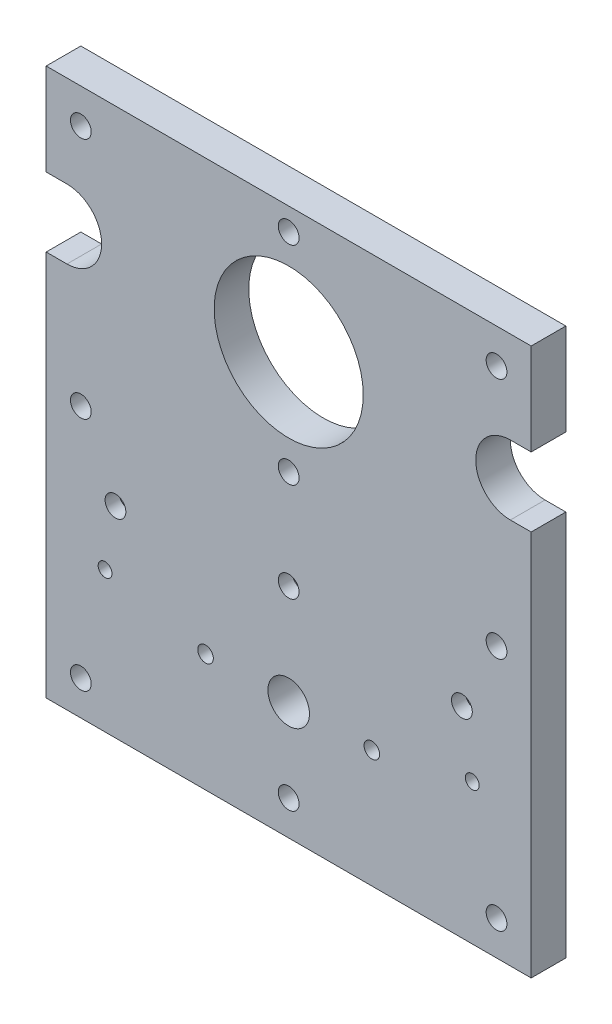
ISO-10303-21;
HEADER;
FILE_DESCRIPTION(('STEP AP214'),'2;1');
FILE_NAME('part.step','',(''),(''),'','','');
FILE_SCHEMA(('AUTOMOTIVE_DESIGN { 1 0 10303 214 1 1 1 1 }'));
ENDSEC;
DATA;
#1=APPLICATION_CONTEXT('core data for automotive mechanical design processes');
#2=APPLICATION_PROTOCOL_DEFINITION('international standard','automotive_design',2000,#1);
#3=PRODUCT_CONTEXT('',#1,'mechanical');
#4=PRODUCT('Part','Part','',(#3));
#5=PRODUCT_RELATED_PRODUCT_CATEGORY('part','',(#4));
#6=PRODUCT_DEFINITION_FORMATION('','',#4);
#7=PRODUCT_DEFINITION_CONTEXT('part definition',#1,'design');
#8=PRODUCT_DEFINITION('design','',#6,#7);
#9=PRODUCT_DEFINITION_SHAPE('','',#8);
#10=(LENGTH_UNIT() NAMED_UNIT(*) SI_UNIT(.MILLI.,.METRE.));
#11=(NAMED_UNIT(*) PLANE_ANGLE_UNIT() SI_UNIT($,.RADIAN.));
#12=(NAMED_UNIT(*) SI_UNIT($,.STERADIAN.) SOLID_ANGLE_UNIT());
#13=UNCERTAINTY_MEASURE_WITH_UNIT(LENGTH_MEASURE(1.E-05),#10,'distance_accuracy_value','');
#14=(GEOMETRIC_REPRESENTATION_CONTEXT(3) GLOBAL_UNCERTAINTY_ASSIGNED_CONTEXT((#13)) GLOBAL_UNIT_ASSIGNED_CONTEXT((#10,
#11,#12)) REPRESENTATION_CONTEXT('',''));
#15=CARTESIAN_POINT('',(0.,0.,0.));
#16=DIRECTION('',(0.,0.,1.));
#17=DIRECTION('',(1.,0.,0.));
#18=AXIS2_PLACEMENT_3D('',#15,#16,#17);
#19=CARTESIAN_POINT('',(123.,40.6,10.));
#20=DIRECTION('',(0.,0.,-1.));
#21=DIRECTION('',(-1.,0.,0.));
#22=AXIS2_PLACEMENT_3D('',#19,#20,#21);
#23=CYLINDRICAL_SURFACE('',#22,1.99999999999998);
#24=CARTESIAN_POINT('',(123.,40.6,10.));
#25=DIRECTION('',(0.,0.,1.));
#26=DIRECTION('',(1.,0.,0.));
#27=AXIS2_PLACEMENT_3D('',#24,#25,#26);
#28=CIRCLE('',#27,1.99999999999998);
#29=CARTESIAN_POINT('',(125.,40.6,10.));
#30=VERTEX_POINT('',#29);
#31=EDGE_CURVE('E224',#30,#30,#28,.T.);
#32=ORIENTED_EDGE('',*,*,#31,.T.);
#33=EDGE_LOOP('',(#32));
#34=FACE_BOUND('',#33,.T.);
#35=CARTESIAN_POINT('',(123.,40.6,4.));
#36=DIRECTION('',(0.,0.,-1.));
#37=DIRECTION('',(-1.,0.,0.));
#38=AXIS2_PLACEMENT_3D('',#35,#36,#37);
#39=CIRCLE('',#38,1.99999999999998);
#40=CARTESIAN_POINT('',(121.,40.6,4.));
#41=VERTEX_POINT('',#40);
#42=EDGE_CURVE('E33',#41,#41,#39,.T.);
#43=ORIENTED_EDGE('',*,*,#42,.T.);
#44=EDGE_LOOP('',(#43));
#45=FACE_BOUND('',#44,.T.);
#46=ADVANCED_FACE('F29',(#34,#45),#23,.F.);
#47=CARTESIAN_POINT('',(17.,40.6,10.));
#48=DIRECTION('',(0.,0.,-1.));
#49=DIRECTION('',(-1.,0.,0.));
#50=AXIS2_PLACEMENT_3D('',#47,#48,#49);
#51=CYLINDRICAL_SURFACE('',#50,2.);
#52=CARTESIAN_POINT('',(17.,40.6,10.));
#53=DIRECTION('',(0.,0.,1.));
#54=DIRECTION('',(1.,0.,0.));
#55=AXIS2_PLACEMENT_3D('',#52,#53,#54);
#56=CIRCLE('',#55,2.);
#57=CARTESIAN_POINT('',(19.,40.6,10.));
#58=VERTEX_POINT('',#57);
#59=EDGE_CURVE('E221',#58,#58,#56,.T.);
#60=ORIENTED_EDGE('',*,*,#59,.T.);
#61=EDGE_LOOP('',(#60));
#62=FACE_BOUND('',#61,.T.);
#63=CARTESIAN_POINT('',(17.,40.6,4.));
#64=DIRECTION('',(0.,0.,-1.));
#65=DIRECTION('',(-1.,0.,0.));
#66=AXIS2_PLACEMENT_3D('',#63,#64,#65);
#67=CIRCLE('',#66,2.);
#68=CARTESIAN_POINT('',(15.,40.6,4.));
#69=VERTEX_POINT('',#68);
#70=EDGE_CURVE('E280',#69,#69,#67,.T.);
#71=ORIENTED_EDGE('',*,*,#70,.T.);
#72=EDGE_LOOP('',(#71));
#73=FACE_BOUND('',#72,.T.);
#74=ADVANCED_FACE('F385',(#62,#73),#51,.F.);
#75=CARTESIAN_POINT('',(0.,0.,10.));
#76=DIRECTION('',(1.,0.,0.));
#77=DIRECTION('',(0.,0.,-1.));
#78=AXIS2_PLACEMENT_3D('',#75,#76,#77);
#79=PLANE('',#78);
#80=DIRECTION('',(0.,-1.,0.));
#81=VECTOR('',#80,1.);
#82=CARTESIAN_POINT('',(0.,0.,10.));
#83=LINE('',#82,#81);
#84=CARTESIAN_POINT('',(0.,111.5,10.));
#85=VERTEX_POINT('',#84);
#86=CARTESIAN_POINT('',(0.,0.,10.));
#87=VERTEX_POINT('',#86);
#88=EDGE_CURVE('E255',#85,#87,#83,.T.);
#89=ORIENTED_EDGE('',*,*,#88,.F.);
#90=DIRECTION('',(0.,0.,-1.));
#91=VECTOR('',#90,1.);
#92=CARTESIAN_POINT('',(0.,111.5,10.));
#93=LINE('',#92,#91);
#94=CARTESIAN_POINT('',(0.,111.5,0.));
#95=VERTEX_POINT('',#94);
#96=EDGE_CURVE('E11',#85,#95,#93,.T.);
#97=ORIENTED_EDGE('',*,*,#96,.T.);
#98=DIRECTION('',(0.,-1.,0.));
#99=VECTOR('',#98,1.);
#100=CARTESIAN_POINT('',(0.,0.,0.));
#101=LINE('',#100,#99);
#102=CARTESIAN_POINT('',(0.,0.,0.));
#103=VERTEX_POINT('',#102);
#104=EDGE_CURVE('E245',#95,#103,#101,.T.);
#105=ORIENTED_EDGE('',*,*,#104,.T.);
#106=DIRECTION('',(0.,0.,-1.));
#107=VECTOR('',#106,1.);
#108=CARTESIAN_POINT('',(0.,0.,10.));
#109=LINE('',#108,#107);
#110=EDGE_CURVE('E266',#87,#103,#109,.T.);
#111=ORIENTED_EDGE('',*,*,#110,.F.);
#112=EDGE_LOOP('',(#89,#97,#105,#111));
#113=FACE_BOUND('',#112,.T.);
#114=ADVANCED_FACE('F391',(#113),#79,.F.);
#115=CARTESIAN_POINT('',(140.,0.,10.));
#116=DIRECTION('',(-1.,0.,0.));
#117=DIRECTION('',(0.,0.,1.));
#118=AXIS2_PLACEMENT_3D('',#115,#116,#117);
#119=PLANE('',#118);
#120=DIRECTION('',(0.,1.,0.));
#121=VECTOR('',#120,1.);
#122=CARTESIAN_POINT('',(140.,0.,10.));
#123=LINE('',#122,#121);
#124=CARTESIAN_POINT('',(140.,131.5,10.));
#125=VERTEX_POINT('',#124);
#126=CARTESIAN_POINT('',(140.,158.,10.));
#127=VERTEX_POINT('',#126);
#128=EDGE_CURVE('E259',#125,#127,#123,.T.);
#129=ORIENTED_EDGE('',*,*,#128,.F.);
#130=DIRECTION('',(0.,0.,-1.));
#131=VECTOR('',#130,1.);
#132=CARTESIAN_POINT('',(140.,131.5,10.));
#133=LINE('',#132,#131);
#134=CARTESIAN_POINT('',(140.,131.5,0.));
#135=VERTEX_POINT('',#134);
#136=EDGE_CURVE('E277',#125,#135,#133,.T.);
#137=ORIENTED_EDGE('',*,*,#136,.T.);
#138=DIRECTION('',(0.,1.,0.));
#139=VECTOR('',#138,1.);
#140=CARTESIAN_POINT('',(140.,0.,0.));
#141=LINE('',#140,#139);
#142=CARTESIAN_POINT('',(140.,158.,0.));
#143=VERTEX_POINT('',#142);
#144=EDGE_CURVE('E251',#135,#143,#141,.T.);
#145=ORIENTED_EDGE('',*,*,#144,.T.);
#146=DIRECTION('',(0.,0.,-1.));
#147=VECTOR('',#146,1.);
#148=CARTESIAN_POINT('',(140.,158.,10.));
#149=LINE('',#148,#147);
#150=EDGE_CURVE('E186',#127,#143,#149,.T.);
#151=ORIENTED_EDGE('',*,*,#150,.F.);
#152=EDGE_LOOP('',(#129,#137,#145,#151));
#153=FACE_BOUND('',#152,.T.);
#154=ADVANCED_FACE('F402',(#153),#119,.F.);
#155=CARTESIAN_POINT('',(20.,58.,10.));
#156=DIRECTION('',(0.,0.,-1.));
#157=DIRECTION('',(-1.,0.,0.));
#158=AXIS2_PLACEMENT_3D('',#155,#156,#157);
#159=CYLINDRICAL_SURFACE('',#158,3.);
#160=CARTESIAN_POINT('',(20.,58.,10.));
#161=DIRECTION('',(0.,0.,-1.));
#162=DIRECTION('',(-1.,0.,0.));
#163=AXIS2_PLACEMENT_3D('',#160,#161,#162);
#164=CIRCLE('',#163,3.);
#165=CARTESIAN_POINT('',(17.,58.,10.));
#166=VERTEX_POINT('',#165);
#167=EDGE_CURVE('E215',#166,#166,#164,.T.);
#168=ORIENTED_EDGE('',*,*,#167,.F.);
#169=EDGE_LOOP('',(#168));
#170=FACE_BOUND('',#169,.T.);
#171=CARTESIAN_POINT('',(20.,58.,6.));
#172=DIRECTION('',(0.,0.,-1.));
#173=DIRECTION('',(-1.,0.,0.));
#174=AXIS2_PLACEMENT_3D('',#171,#172,#173);
#175=CIRCLE('',#174,3.);
#176=CARTESIAN_POINT('',(17.,58.,6.));
#177=VERTEX_POINT('',#176);
#178=EDGE_CURVE('E197',#177,#177,#175,.F.);
#179=ORIENTED_EDGE('',*,*,#178,.F.);
#180=EDGE_LOOP('',(#179));
#181=FACE_BOUND('',#180,.T.);
#182=ADVANCED_FACE('F400',(#170,#181),#159,.F.);
#183=CARTESIAN_POINT('',(70.,63.0000000000075,10.));
#184=DIRECTION('',(0.,0.,-1.));
#185=DIRECTION('',(-1.,0.,0.));
#186=AXIS2_PLACEMENT_3D('',#183,#184,#185);
#187=CYLINDRICAL_SURFACE('',#186,3.00000000000001);
#188=CARTESIAN_POINT('',(70.,63.0000000000075,10.));
#189=DIRECTION('',(0.,0.,-1.));
#190=DIRECTION('',(-1.,0.,0.));
#191=AXIS2_PLACEMENT_3D('',#188,#189,#190);
#192=CIRCLE('',#191,3.00000000000001);
#193=CARTESIAN_POINT('',(67.,63.0000000000075,10.));
#194=VERTEX_POINT('',#193);
#195=EDGE_CURVE('E212',#194,#194,#192,.T.);
#196=ORIENTED_EDGE('',*,*,#195,.F.);
#197=EDGE_LOOP('',(#196));
#198=FACE_BOUND('',#197,.T.);
#199=CARTESIAN_POINT('',(70.,63.0000000000075,6.));
#200=DIRECTION('',(0.,0.,-1.));
#201=DIRECTION('',(-1.,0.,0.));
#202=AXIS2_PLACEMENT_3D('',#199,#200,#201);
#203=CIRCLE('',#202,3.00000000000001);
#204=CARTESIAN_POINT('',(67.,63.0000000000075,6.));
#205=VERTEX_POINT('',#204);
#206=EDGE_CURVE('E204',#205,#205,#203,.F.);
#207=ORIENTED_EDGE('',*,*,#206,.F.);
#208=EDGE_LOOP('',(#207));
#209=FACE_BOUND('',#208,.T.);
#210=ADVANCED_FACE('F398',(#198,#209),#187,.F.);
#211=CARTESIAN_POINT('',(120.,58.,10.));
#212=DIRECTION('',(0.,0.,-1.));
#213=DIRECTION('',(-1.,0.,0.));
#214=AXIS2_PLACEMENT_3D('',#211,#212,#213);
#215=CYLINDRICAL_SURFACE('',#214,3.00000000000001);
#216=CARTESIAN_POINT('',(120.,58.,10.));
#217=DIRECTION('',(0.,0.,-1.));
#218=DIRECTION('',(-1.,0.,0.));
#219=AXIS2_PLACEMENT_3D('',#216,#217,#218);
#220=CIRCLE('',#219,3.00000000000001);
#221=CARTESIAN_POINT('',(117.,58.,10.));
#222=VERTEX_POINT('',#221);
#223=EDGE_CURVE('E218',#222,#222,#220,.T.);
#224=ORIENTED_EDGE('',*,*,#223,.F.);
#225=EDGE_LOOP('',(#224));
#226=FACE_BOUND('',#225,.T.);
#227=CARTESIAN_POINT('',(120.,58.,6.));
#228=DIRECTION('',(0.,0.,-1.));
#229=DIRECTION('',(-1.,0.,0.));
#230=AXIS2_PLACEMENT_3D('',#227,#228,#229);
#231=CIRCLE('',#230,3.00000000000001);
#232=CARTESIAN_POINT('',(117.,58.,6.));
#233=VERTEX_POINT('',#232);
#234=EDGE_CURVE('E211',#233,#233,#231,.F.);
#235=ORIENTED_EDGE('',*,*,#234,.F.);
#236=EDGE_LOOP('',(#235));
#237=FACE_BOUND('',#236,.T.);
#238=ADVANCED_FACE('F341',(#226,#237),#215,.F.);
#239=CARTESIAN_POINT('',(0.,68.,10.));
#240=DIRECTION('',(0.,0.,-1.));
#241=DIRECTION('',(-1.,0.,0.));
#242=AXIS2_PLACEMENT_3D('',#239,#240,#241);
#243=PLANE('',#242);
#244=CARTESIAN_POINT('',(70.,10.,10.));
#245=DIRECTION('',(0.,0.,1.));
#246=DIRECTION('',(1.,0.,0.));
#247=AXIS2_PLACEMENT_3D('',#244,#245,#246);
#248=CIRCLE('',#247,3.00000000000001);
#249=CARTESIAN_POINT('',(73.,10.,10.));
#250=VERTEX_POINT('',#249);
#251=EDGE_CURVE('E506',#250,#250,#248,.T.);
#252=ORIENTED_EDGE('',*,*,#251,.F.);
#253=EDGE_LOOP('',(#252));
#254=FACE_BOUND('',#253,.T.);
#255=CARTESIAN_POINT('',(10.,10.,10.));
#256=DIRECTION('',(0.,0.,1.));
#257=DIRECTION('',(1.,0.,0.));
#258=AXIS2_PLACEMENT_3D('',#255,#256,#257);
#259=CIRCLE('',#258,3.);
#260=CARTESIAN_POINT('',(13.,10.,10.));
#261=VERTEX_POINT('',#260);
#262=EDGE_CURVE('E508',#261,#261,#259,.T.);
#263=ORIENTED_EDGE('',*,*,#262,.F.);
#264=EDGE_LOOP('',(#263));
#265=FACE_BOUND('',#264,.T.);
#266=CARTESIAN_POINT('',(130.,10.,10.));
#267=DIRECTION('',(0.,0.,1.));
#268=DIRECTION('',(1.,0.,0.));
#269=AXIS2_PLACEMENT_3D('',#266,#267,#268);
#270=CIRCLE('',#269,2.99999999999999);
#271=CARTESIAN_POINT('',(133.,10.,10.));
#272=VERTEX_POINT('',#271);
#273=EDGE_CURVE('E516',#272,#272,#270,.T.);
#274=ORIENTED_EDGE('',*,*,#273,.F.);
#275=EDGE_LOOP('',(#274));
#276=FACE_BOUND('',#275,.T.);
#277=CARTESIAN_POINT('',(70.,121.5,10.));
#278=DIRECTION('',(0.,0.,1.));
#279=DIRECTION('',(1.,0.,0.));
#280=AXIS2_PLACEMENT_3D('',#277,#278,#279);
#281=CIRCLE('',#280,21.525);
#282=CARTESIAN_POINT('',(91.525,121.5,10.));
#283=VERTEX_POINT('',#282);
#284=EDGE_CURVE('E282',#283,#283,#281,.T.);
#285=ORIENTED_EDGE('',*,*,#284,.F.);
#286=EDGE_LOOP('',(#285));
#287=FACE_BOUND('',#286,.T.);
#288=CARTESIAN_POINT('',(130.,148.,10.));
#289=DIRECTION('',(0.,0.,1.));
#290=DIRECTION('',(1.,0.,0.));
#291=AXIS2_PLACEMENT_3D('',#288,#289,#290);
#292=CIRCLE('',#291,2.99999999999999);
#293=CARTESIAN_POINT('',(133.,148.,10.));
#294=VERTEX_POINT('',#293);
#295=EDGE_CURVE('E300',#294,#294,#292,.T.);
#296=ORIENTED_EDGE('',*,*,#295,.F.);
#297=EDGE_LOOP('',(#296));
#298=FACE_BOUND('',#297,.T.);
#299=CARTESIAN_POINT('',(130.,78.,10.));
#300=DIRECTION('',(0.,0.,1.));
#301=DIRECTION('',(1.,0.,0.));
#302=AXIS2_PLACEMENT_3D('',#299,#300,#301);
#303=CIRCLE('',#302,2.99999999999999);
#304=CARTESIAN_POINT('',(133.,78.,10.));
#305=VERTEX_POINT('',#304);
#306=EDGE_CURVE('E306',#305,#305,#303,.T.);
#307=ORIENTED_EDGE('',*,*,#306,.F.);
#308=EDGE_LOOP('',(#307));
#309=FACE_BOUND('',#308,.T.);
#310=CARTESIAN_POINT('',(10.,148.,10.));
#311=DIRECTION('',(0.,0.,1.));
#312=DIRECTION('',(1.,0.,0.));
#313=AXIS2_PLACEMENT_3D('',#310,#311,#312);
#314=CIRCLE('',#313,3.);
#315=CARTESIAN_POINT('',(13.,148.,10.));
#316=VERTEX_POINT('',#315);
#317=EDGE_CURVE('E312',#316,#316,#314,.T.);
#318=ORIENTED_EDGE('',*,*,#317,.F.);
#319=EDGE_LOOP('',(#318));
#320=FACE_BOUND('',#319,.T.);
#321=CARTESIAN_POINT('',(10.,78.,10.));
#322=DIRECTION('',(0.,0.,1.));
#323=DIRECTION('',(1.,0.,0.));
#324=AXIS2_PLACEMENT_3D('',#321,#322,#323);
#325=CIRCLE('',#324,3.);
#326=CARTESIAN_POINT('',(13.,78.,10.));
#327=VERTEX_POINT('',#326);
#328=EDGE_CURVE('E318',#327,#327,#325,.T.);
#329=ORIENTED_EDGE('',*,*,#328,.F.);
#330=EDGE_LOOP('',(#329));
#331=FACE_BOUND('',#330,.T.);
#332=CARTESIAN_POINT('',(70.,91.5000000000075,10.));
#333=DIRECTION('',(0.,0.,1.));
#334=DIRECTION('',(1.,0.,0.));
#335=AXIS2_PLACEMENT_3D('',#332,#333,#334);
#336=CIRCLE('',#335,3.00000000000001);
#337=CARTESIAN_POINT('',(73.,91.5000000000075,10.));
#338=VERTEX_POINT('',#337);
#339=EDGE_CURVE('E324',#338,#338,#336,.T.);
#340=ORIENTED_EDGE('',*,*,#339,.F.);
#341=EDGE_LOOP('',(#340));
#342=FACE_BOUND('',#341,.T.);
#343=CARTESIAN_POINT('',(70.,151.5,10.));
#344=DIRECTION('',(0.,0.,1.));
#345=DIRECTION('',(1.,0.,0.));
#346=AXIS2_PLACEMENT_3D('',#343,#344,#345);
#347=CIRCLE('',#346,3.00000000000001);
#348=CARTESIAN_POINT('',(73.,151.5,10.));
#349=VERTEX_POINT('',#348);
#350=EDGE_CURVE('E172',#349,#349,#347,.T.);
#351=ORIENTED_EDGE('',*,*,#350,.F.);
#352=EDGE_LOOP('',(#351));
#353=FACE_BOUND('',#352,.T.);
#354=ORIENTED_EDGE('',*,*,#195,.T.);
#355=EDGE_LOOP('',(#354));
#356=FACE_BOUND('',#355,.T.);
#357=ORIENTED_EDGE('',*,*,#167,.T.);
#358=EDGE_LOOP('',(#357));
#359=FACE_BOUND('',#358,.T.);
#360=ORIENTED_EDGE('',*,*,#223,.T.);
#361=EDGE_LOOP('',(#360));
#362=FACE_BOUND('',#361,.T.);
#363=ORIENTED_EDGE('',*,*,#31,.F.);
#364=EDGE_LOOP('',(#363));
#365=FACE_BOUND('',#364,.T.);
#366=CARTESIAN_POINT('',(94.,33.9999999999924,10.));
#367=DIRECTION('',(0.,0.,1.));
#368=DIRECTION('',(1.,0.,0.));
#369=AXIS2_PLACEMENT_3D('',#366,#367,#368);
#370=CIRCLE('',#369,2.25);
#371=CARTESIAN_POINT('',(96.25,33.9999999999924,10.));
#372=VERTEX_POINT('',#371);
#373=EDGE_CURVE('E236',#372,#372,#370,.T.);
#374=ORIENTED_EDGE('',*,*,#373,.F.);
#375=EDGE_LOOP('',(#374));
#376=FACE_BOUND('',#375,.T.);
#377=CARTESIAN_POINT('',(6.00000000000001,121.5,10.));
#378=DIRECTION('',(0.,0.,1.));
#379=DIRECTION('',(1.,0.,0.));
#380=AXIS2_PLACEMENT_3D('',#377,#378,#379);
#381=CIRCLE('',#380,10.);
#382=CARTESIAN_POINT('',(6.00000000000001,111.5,10.));
#383=VERTEX_POINT('',#382);
#384=CARTESIAN_POINT('',(6.00000000000001,131.5,10.));
#385=VERTEX_POINT('',#384);
#386=EDGE_CURVE('E131',#383,#385,#381,.T.);
#387=ORIENTED_EDGE('',*,*,#386,.F.);
#388=DIRECTION('',(1.,0.,0.));
#389=VECTOR('',#388,1.);
#390=CARTESIAN_POINT('',(-3.99999999999999,111.5,10.));
#391=LINE('',#390,#389);
#392=EDGE_CURVE('E142',#85,#383,#391,.T.);
#393=ORIENTED_EDGE('',*,*,#392,.F.);
#394=ORIENTED_EDGE('',*,*,#88,.T.);
#395=DIRECTION('',(1.,0.,0.));
#396=VECTOR('',#395,1.);
#397=CARTESIAN_POINT('',(0.,0.,10.));
#398=LINE('',#397,#396);
#399=CARTESIAN_POINT('',(140.,0.,10.));
#400=VERTEX_POINT('',#399);
#401=EDGE_CURVE('E257',#87,#400,#398,.T.);
#402=ORIENTED_EDGE('',*,*,#401,.T.);
#403=CARTESIAN_POINT('',(140.,111.5,10.));
#404=VERTEX_POINT('',#403);
#405=EDGE_CURVE('E260',#400,#404,#123,.T.);
#406=ORIENTED_EDGE('',*,*,#405,.T.);
#407=DIRECTION('',(1.,0.,0.));
#408=VECTOR('',#407,1.);
#409=CARTESIAN_POINT('',(144.,111.5,10.));
#410=LINE('',#409,#408);
#411=CARTESIAN_POINT('',(134.,111.5,10.));
#412=VERTEX_POINT('',#411);
#413=EDGE_CURVE('E54',#412,#404,#410,.T.);
#414=ORIENTED_EDGE('',*,*,#413,.F.);
#415=CARTESIAN_POINT('',(134.,121.5,10.));
#416=DIRECTION('',(0.,0.,1.));
#417=DIRECTION('',(1.,0.,0.));
#418=AXIS2_PLACEMENT_3D('',#415,#416,#417);
#419=CIRCLE('',#418,10.);
#420=CARTESIAN_POINT('',(134.,131.5,10.));
#421=VERTEX_POINT('',#420);
#422=EDGE_CURVE('E152',#421,#412,#419,.T.);
#423=ORIENTED_EDGE('',*,*,#422,.F.);
#424=DIRECTION('',(-1.,0.,0.));
#425=VECTOR('',#424,1.);
#426=CARTESIAN_POINT('',(134.,131.5,10.));
#427=LINE('',#426,#425);
#428=EDGE_CURVE('E157',#125,#421,#427,.T.);
#429=ORIENTED_EDGE('',*,*,#428,.F.);
#430=ORIENTED_EDGE('',*,*,#128,.T.);
#431=DIRECTION('',(1.,0.,0.));
#432=VECTOR('',#431,1.);
#433=CARTESIAN_POINT('',(-94.3401424231202,158.,10.));
#434=LINE('',#433,#432);
#435=CARTESIAN_POINT('',(0.,158.,10.));
#436=VERTEX_POINT('',#435);
#437=EDGE_CURVE('E182',#436,#127,#434,.T.);
#438=ORIENTED_EDGE('',*,*,#437,.F.);
#439=CARTESIAN_POINT('',(0.,131.5,10.));
#440=VERTEX_POINT('',#439);
#441=EDGE_CURVE('E141',#436,#440,#83,.T.);
#442=ORIENTED_EDGE('',*,*,#441,.T.);
#443=DIRECTION('',(-1.,0.,0.));
#444=VECTOR('',#443,1.);
#445=CARTESIAN_POINT('',(6.00000000000001,131.5,10.));
#446=LINE('',#445,#444);
#447=EDGE_CURVE('E46',#385,#440,#446,.T.);
#448=ORIENTED_EDGE('',*,*,#447,.F.);
#449=EDGE_LOOP('',(#387,#393,#394,#402,#406,#414,#423,#429,#430,#438,#442,#448));
#450=FACE_BOUND('',#449,.T.);
#451=CARTESIAN_POINT('',(70.,33.9999999999925,10.));
#452=DIRECTION('',(0.,0.,1.));
#453=DIRECTION('',(1.,0.,0.));
#454=AXIS2_PLACEMENT_3D('',#451,#452,#453);
#455=CIRCLE('',#454,5.99999999999999);
#456=CARTESIAN_POINT('',(76.,33.9999999999925,10.));
#457=VERTEX_POINT('',#456);
#458=EDGE_CURVE('E242',#457,#457,#455,.T.);
#459=ORIENTED_EDGE('',*,*,#458,.F.);
#460=EDGE_LOOP('',(#459));
#461=FACE_BOUND('',#460,.T.);
#462=CARTESIAN_POINT('',(46.,33.9999999999926,10.));
#463=DIRECTION('',(0.,0.,1.));
#464=DIRECTION('',(1.,0.,0.));
#465=AXIS2_PLACEMENT_3D('',#462,#463,#464);
#466=CIRCLE('',#465,2.25);
#467=CARTESIAN_POINT('',(48.25,33.9999999999926,10.));
#468=VERTEX_POINT('',#467);
#469=EDGE_CURVE('E230',#468,#468,#466,.T.);
#470=ORIENTED_EDGE('',*,*,#469,.F.);
#471=EDGE_LOOP('',(#470));
#472=FACE_BOUND('',#471,.T.);
#473=ORIENTED_EDGE('',*,*,#59,.F.);
#474=EDGE_LOOP('',(#473));
#475=FACE_BOUND('',#474,.T.);
#476=ADVANCED_FACE('F138',(#254,#265,#276,#287,#298,#309,#320,#331,#342,#353,#356,#359,#362,
#365,#376,#450,#461,#472,#475),#243,.F.);
#477=CARTESIAN_POINT('',(0.,68.,0.));
#478=DIRECTION('',(0.,0.,-1.));
#479=DIRECTION('',(-1.,0.,0.));
#480=AXIS2_PLACEMENT_3D('',#477,#478,#479);
#481=PLANE('',#480);
#482=CARTESIAN_POINT('',(70.,10.,0.));
#483=DIRECTION('',(0.,0.,1.));
#484=DIRECTION('',(1.,0.,0.));
#485=AXIS2_PLACEMENT_3D('',#482,#483,#484);
#486=CIRCLE('',#485,3.00000000000001);
#487=CARTESIAN_POINT('',(73.,10.,0.));
#488=VERTEX_POINT('',#487);
#489=EDGE_CURVE('E503',#488,#488,#486,.T.);
#490=ORIENTED_EDGE('',*,*,#489,.T.);
#491=EDGE_LOOP('',(#490));
#492=FACE_BOUND('',#491,.T.);
#493=CARTESIAN_POINT('',(10.,10.,0.));
#494=DIRECTION('',(0.,0.,1.));
#495=DIRECTION('',(1.,0.,0.));
#496=AXIS2_PLACEMENT_3D('',#493,#494,#495);
#497=CIRCLE('',#496,3.);
#498=CARTESIAN_POINT('',(13.,10.,0.));
#499=VERTEX_POINT('',#498);
#500=EDGE_CURVE('E513',#499,#499,#497,.T.);
#501=ORIENTED_EDGE('',*,*,#500,.T.);
#502=EDGE_LOOP('',(#501));
#503=FACE_BOUND('',#502,.T.);
#504=CARTESIAN_POINT('',(130.,10.,0.));
#505=DIRECTION('',(0.,0.,1.));
#506=DIRECTION('',(1.,0.,0.));
#507=AXIS2_PLACEMENT_3D('',#504,#505,#506);
#508=CIRCLE('',#507,2.99999999999999);
#509=CARTESIAN_POINT('',(133.,10.,0.));
#510=VERTEX_POINT('',#509);
#511=EDGE_CURVE('E519',#510,#510,#508,.T.);
#512=ORIENTED_EDGE('',*,*,#511,.T.);
#513=EDGE_LOOP('',(#512));
#514=FACE_BOUND('',#513,.T.);
#515=CARTESIAN_POINT('',(123.,40.6,0.));
#516=DIRECTION('',(0.,0.,-1.));
#517=DIRECTION('',(-1.,0.,0.));
#518=AXIS2_PLACEMENT_3D('',#515,#516,#517);
#519=CIRCLE('',#518,3.50000000000001);
#520=CARTESIAN_POINT('',(119.5,40.6,0.));
#521=VERTEX_POINT('',#520);
#522=EDGE_CURVE('E522',#521,#521,#519,.T.);
#523=ORIENTED_EDGE('',*,*,#522,.F.);
#524=EDGE_LOOP('',(#523));
#525=FACE_BOUND('',#524,.T.);
#526=CARTESIAN_POINT('',(17.,40.6,0.));
#527=DIRECTION('',(0.,0.,-1.));
#528=DIRECTION('',(-1.,0.,0.));
#529=AXIS2_PLACEMENT_3D('',#526,#527,#528);
#530=CIRCLE('',#529,3.5);
#531=CARTESIAN_POINT('',(13.5,40.6,0.));
#532=VERTEX_POINT('',#531);
#533=EDGE_CURVE('E290',#532,#532,#530,.T.);
#534=ORIENTED_EDGE('',*,*,#533,.F.);
#535=EDGE_LOOP('',(#534));
#536=FACE_BOUND('',#535,.T.);
#537=CARTESIAN_POINT('',(70.,121.5,0.));
#538=DIRECTION('',(0.,0.,1.));
#539=DIRECTION('',(1.,0.,0.));
#540=AXIS2_PLACEMENT_3D('',#537,#538,#539);
#541=CIRCLE('',#540,21.525);
#542=CARTESIAN_POINT('',(91.525,121.5,0.));
#543=VERTEX_POINT('',#542);
#544=EDGE_CURVE('E287',#543,#543,#541,.T.);
#545=ORIENTED_EDGE('',*,*,#544,.T.);
#546=EDGE_LOOP('',(#545));
#547=FACE_BOUND('',#546,.T.);
#548=CARTESIAN_POINT('',(130.,148.,0.));
#549=DIRECTION('',(0.,0.,1.));
#550=DIRECTION('',(1.,0.,0.));
#551=AXIS2_PLACEMENT_3D('',#548,#549,#550);
#552=CIRCLE('',#551,2.99999999999999);
#553=CARTESIAN_POINT('',(133.,148.,0.));
#554=VERTEX_POINT('',#553);
#555=EDGE_CURVE('E303',#554,#554,#552,.T.);
#556=ORIENTED_EDGE('',*,*,#555,.T.);
#557=EDGE_LOOP('',(#556));
#558=FACE_BOUND('',#557,.T.);
#559=CARTESIAN_POINT('',(130.,78.,0.));
#560=DIRECTION('',(0.,0.,1.));
#561=DIRECTION('',(1.,0.,0.));
#562=AXIS2_PLACEMENT_3D('',#559,#560,#561);
#563=CIRCLE('',#562,2.99999999999999);
#564=CARTESIAN_POINT('',(133.,78.,0.));
#565=VERTEX_POINT('',#564);
#566=EDGE_CURVE('E309',#565,#565,#563,.T.);
#567=ORIENTED_EDGE('',*,*,#566,.T.);
#568=EDGE_LOOP('',(#567));
#569=FACE_BOUND('',#568,.T.);
#570=CARTESIAN_POINT('',(10.,148.,0.));
#571=DIRECTION('',(0.,0.,1.));
#572=DIRECTION('',(1.,0.,0.));
#573=AXIS2_PLACEMENT_3D('',#570,#571,#572);
#574=CIRCLE('',#573,3.);
#575=CARTESIAN_POINT('',(13.,148.,0.));
#576=VERTEX_POINT('',#575);
#577=EDGE_CURVE('E315',#576,#576,#574,.T.);
#578=ORIENTED_EDGE('',*,*,#577,.T.);
#579=EDGE_LOOP('',(#578));
#580=FACE_BOUND('',#579,.T.);
#581=CARTESIAN_POINT('',(10.,78.,0.));
#582=DIRECTION('',(0.,0.,1.));
#583=DIRECTION('',(1.,0.,0.));
#584=AXIS2_PLACEMENT_3D('',#581,#582,#583);
#585=CIRCLE('',#584,3.);
#586=CARTESIAN_POINT('',(13.,78.,0.));
#587=VERTEX_POINT('',#586);
#588=EDGE_CURVE('E321',#587,#587,#585,.T.);
#589=ORIENTED_EDGE('',*,*,#588,.T.);
#590=EDGE_LOOP('',(#589));
#591=FACE_BOUND('',#590,.T.);
#592=CARTESIAN_POINT('',(70.,91.5000000000075,0.));
#593=DIRECTION('',(0.,0.,1.));
#594=DIRECTION('',(1.,0.,0.));
#595=AXIS2_PLACEMENT_3D('',#592,#593,#594);
#596=CIRCLE('',#595,3.00000000000001);
#597=CARTESIAN_POINT('',(73.,91.5000000000075,0.));
#598=VERTEX_POINT('',#597);
#599=EDGE_CURVE('E135',#598,#598,#596,.T.);
#600=ORIENTED_EDGE('',*,*,#599,.T.);
#601=EDGE_LOOP('',(#600));
#602=FACE_BOUND('',#601,.T.);
#603=DIRECTION('',(1.,0.,0.));
#604=VECTOR('',#603,1.);
#605=CARTESIAN_POINT('',(-3.99999999999999,111.5,0.));
#606=LINE('',#605,#604);
#607=CARTESIAN_POINT('',(6.00000000000001,111.5,0.));
#608=VERTEX_POINT('',#607);
#609=EDGE_CURVE('E127',#95,#608,#606,.T.);
#610=ORIENTED_EDGE('',*,*,#609,.T.);
#611=CARTESIAN_POINT('',(6.00000000000001,121.5,0.));
#612=DIRECTION('',(0.,0.,1.));
#613=DIRECTION('',(1.,0.,0.));
#614=AXIS2_PLACEMENT_3D('',#611,#612,#613);
#615=CIRCLE('',#614,10.);
#616=CARTESIAN_POINT('',(6.00000000000001,131.5,0.));
#617=VERTEX_POINT('',#616);
#618=EDGE_CURVE('E144',#608,#617,#615,.T.);
#619=ORIENTED_EDGE('',*,*,#618,.T.);
#620=DIRECTION('',(-1.,0.,0.));
#621=VECTOR('',#620,1.);
#622=CARTESIAN_POINT('',(6.00000000000001,131.5,0.));
#623=LINE('',#622,#621);
#624=CARTESIAN_POINT('',(0.,131.5,0.));
#625=VERTEX_POINT('',#624);
#626=EDGE_CURVE('E122',#617,#625,#623,.T.);
#627=ORIENTED_EDGE('',*,*,#626,.T.);
#628=CARTESIAN_POINT('',(0.,158.,0.));
#629=VERTEX_POINT('',#628);
#630=EDGE_CURVE('E246',#629,#625,#101,.T.);
#631=ORIENTED_EDGE('',*,*,#630,.F.);
#632=DIRECTION('',(1.,0.,0.));
#633=VECTOR('',#632,1.);
#634=CARTESIAN_POINT('',(-94.3401424231202,158.,0.));
#635=LINE('',#634,#633);
#636=EDGE_CURVE('E179',#629,#143,#635,.T.);
#637=ORIENTED_EDGE('',*,*,#636,.T.);
#638=ORIENTED_EDGE('',*,*,#144,.F.);
#639=DIRECTION('',(-1.,0.,0.));
#640=VECTOR('',#639,1.);
#641=CARTESIAN_POINT('',(134.,131.5,0.));
#642=LINE('',#641,#640);
#643=CARTESIAN_POINT('',(134.,131.5,0.));
#644=VERTEX_POINT('',#643);
#645=EDGE_CURVE('E165',#135,#644,#642,.T.);
#646=ORIENTED_EDGE('',*,*,#645,.T.);
#647=CARTESIAN_POINT('',(134.,121.5,0.));
#648=DIRECTION('',(0.,0.,1.));
#649=DIRECTION('',(1.,0.,0.));
#650=AXIS2_PLACEMENT_3D('',#647,#648,#649);
#651=CIRCLE('',#650,10.);
#652=CARTESIAN_POINT('',(134.,111.5,0.));
#653=VERTEX_POINT('',#652);
#654=EDGE_CURVE('E159',#644,#653,#651,.T.);
#655=ORIENTED_EDGE('',*,*,#654,.T.);
#656=DIRECTION('',(1.,0.,0.));
#657=VECTOR('',#656,1.);
#658=CARTESIAN_POINT('',(144.,111.5,0.));
#659=LINE('',#658,#657);
#660=CARTESIAN_POINT('',(140.,111.5,0.));
#661=VERTEX_POINT('',#660);
#662=EDGE_CURVE('E162',#653,#661,#659,.T.);
#663=ORIENTED_EDGE('',*,*,#662,.T.);
#664=CARTESIAN_POINT('',(140.,0.,0.));
#665=VERTEX_POINT('',#664);
#666=EDGE_CURVE('E252',#665,#661,#141,.T.);
#667=ORIENTED_EDGE('',*,*,#666,.F.);
#668=DIRECTION('',(1.,0.,0.));
#669=VECTOR('',#668,1.);
#670=CARTESIAN_POINT('',(0.,0.,0.));
#671=LINE('',#670,#669);
#672=EDGE_CURVE('E249',#103,#665,#671,.T.);
#673=ORIENTED_EDGE('',*,*,#672,.F.);
#674=ORIENTED_EDGE('',*,*,#104,.F.);
#675=EDGE_LOOP('',(#610,#619,#627,#631,#637,#638,#646,#655,#663,#667,#673,#674));
#676=FACE_BOUND('',#675,.T.);
#677=CARTESIAN_POINT('',(70.,151.5,0.));
#678=DIRECTION('',(0.,0.,1.));
#679=DIRECTION('',(1.,0.,0.));
#680=AXIS2_PLACEMENT_3D('',#677,#678,#679);
#681=CIRCLE('',#680,3.00000000000001);
#682=CARTESIAN_POINT('',(73.,151.5,0.));
#683=VERTEX_POINT('',#682);
#684=EDGE_CURVE('E176',#683,#683,#681,.T.);
#685=ORIENTED_EDGE('',*,*,#684,.T.);
#686=EDGE_LOOP('',(#685));
#687=FACE_BOUND('',#686,.T.);
#688=CARTESIAN_POINT('',(20.,58.,0.));
#689=DIRECTION('',(0.,0.,-1.));
#690=DIRECTION('',(-1.,0.,0.));
#691=AXIS2_PLACEMENT_3D('',#688,#689,#690);
#692=CIRCLE('',#691,5.);
#693=CARTESIAN_POINT('',(15.,58.,0.));
#694=VERTEX_POINT('',#693);
#695=EDGE_CURVE('E189',#694,#694,#692,.T.);
#696=ORIENTED_EDGE('',*,*,#695,.F.);
#697=EDGE_LOOP('',(#696));
#698=FACE_BOUND('',#697,.T.);
#699=CARTESIAN_POINT('',(70.,63.0000000000075,0.));
#700=DIRECTION('',(0.,0.,-1.));
#701=DIRECTION('',(-1.,0.,0.));
#702=AXIS2_PLACEMENT_3D('',#699,#700,#701);
#703=CIRCLE('',#702,4.98999999999999);
#704=CARTESIAN_POINT('',(65.01,63.0000000000075,0.));
#705=VERTEX_POINT('',#704);
#706=EDGE_CURVE('E198',#705,#705,#703,.T.);
#707=ORIENTED_EDGE('',*,*,#706,.F.);
#708=EDGE_LOOP('',(#707));
#709=FACE_BOUND('',#708,.T.);
#710=CARTESIAN_POINT('',(120.,58.,0.));
#711=DIRECTION('',(0.,0.,-1.));
#712=DIRECTION('',(-1.,0.,0.));
#713=AXIS2_PLACEMENT_3D('',#710,#711,#712);
#714=CIRCLE('',#713,5.00000000000001);
#715=CARTESIAN_POINT('',(115.,58.,0.));
#716=VERTEX_POINT('',#715);
#717=EDGE_CURVE('E205',#716,#716,#714,.T.);
#718=ORIENTED_EDGE('',*,*,#717,.F.);
#719=EDGE_LOOP('',(#718));
#720=FACE_BOUND('',#719,.T.);
#721=CARTESIAN_POINT('',(94.,33.9999999999924,0.));
#722=DIRECTION('',(0.,0.,1.));
#723=DIRECTION('',(1.,0.,0.));
#724=AXIS2_PLACEMENT_3D('',#721,#722,#723);
#725=CIRCLE('',#724,2.25);
#726=CARTESIAN_POINT('',(96.25,33.9999999999924,0.));
#727=VERTEX_POINT('',#726);
#728=EDGE_CURVE('E233',#727,#727,#725,.T.);
#729=ORIENTED_EDGE('',*,*,#728,.T.);
#730=EDGE_LOOP('',(#729));
#731=FACE_BOUND('',#730,.T.);
#732=CARTESIAN_POINT('',(70.,33.9999999999925,0.));
#733=DIRECTION('',(0.,0.,1.));
#734=DIRECTION('',(1.,0.,0.));
#735=AXIS2_PLACEMENT_3D('',#732,#733,#734);
#736=CIRCLE('',#735,5.99999999999999);
#737=CARTESIAN_POINT('',(76.,33.9999999999925,0.));
#738=VERTEX_POINT('',#737);
#739=EDGE_CURVE('E239',#738,#738,#736,.T.);
#740=ORIENTED_EDGE('',*,*,#739,.T.);
#741=EDGE_LOOP('',(#740));
#742=FACE_BOUND('',#741,.T.);
#743=CARTESIAN_POINT('',(46.,33.9999999999926,0.));
#744=DIRECTION('',(0.,0.,1.));
#745=DIRECTION('',(1.,0.,0.));
#746=AXIS2_PLACEMENT_3D('',#743,#744,#745);
#747=CIRCLE('',#746,2.25);
#748=CARTESIAN_POINT('',(48.25,33.9999999999926,0.));
#749=VERTEX_POINT('',#748);
#750=EDGE_CURVE('E227',#749,#749,#747,.T.);
#751=ORIENTED_EDGE('',*,*,#750,.T.);
#752=EDGE_LOOP('',(#751));
#753=FACE_BOUND('',#752,.T.);
#754=ADVANCED_FACE('F329',(#492,#503,#514,#525,#536,#547,#558,#569,#580,#591,#602,#676,#687,
#698,#709,#720,#731,#742,#753),#481,.T.);
#755=ORIENTED_EDGE('',*,*,#630,.T.);
#756=DIRECTION('',(0.,0.,1.));
#757=VECTOR('',#756,1.);
#758=CARTESIAN_POINT('',(0.,131.5,10.));
#759=LINE('',#758,#757);
#760=EDGE_CURVE('E38',#625,#440,#759,.T.);
#761=ORIENTED_EDGE('',*,*,#760,.T.);
#762=ORIENTED_EDGE('',*,*,#441,.F.);
#763=DIRECTION('',(0.,0.,-1.));
#764=VECTOR('',#763,1.);
#765=CARTESIAN_POINT('',(0.,158.,10.));
#766=LINE('',#765,#764);
#767=EDGE_CURVE('E185',#436,#629,#766,.T.);
#768=ORIENTED_EDGE('',*,*,#767,.T.);
#769=EDGE_LOOP('',(#755,#761,#762,#768));
#770=FACE_BOUND('',#769,.T.);
#771=ADVANCED_FACE('F31',(#770),#79,.F.);
#772=CARTESIAN_POINT('',(0.,0.,10.));
#773=DIRECTION('',(0.,1.,0.));
#774=DIRECTION('',(0.,0.,1.));
#775=AXIS2_PLACEMENT_3D('',#772,#773,#774);
#776=PLANE('',#775);
#777=ORIENTED_EDGE('',*,*,#672,.T.);
#778=DIRECTION('',(0.,0.,-1.));
#779=VECTOR('',#778,1.);
#780=CARTESIAN_POINT('',(140.,0.,10.));
#781=LINE('',#780,#779);
#782=EDGE_CURVE('E263',#400,#665,#781,.T.);
#783=ORIENTED_EDGE('',*,*,#782,.F.);
#784=ORIENTED_EDGE('',*,*,#401,.F.);
#785=ORIENTED_EDGE('',*,*,#110,.T.);
#786=EDGE_LOOP('',(#777,#783,#784,#785));
#787=FACE_BOUND('',#786,.T.);
#788=ADVANCED_FACE('F689',(#787),#776,.F.);
#789=ORIENTED_EDGE('',*,*,#666,.T.);
#790=DIRECTION('',(0.,0.,1.));
#791=VECTOR('',#790,1.);
#792=CARTESIAN_POINT('',(140.,111.5,10.));
#793=LINE('',#792,#791);
#794=EDGE_CURVE('E269',#661,#404,#793,.T.);
#795=ORIENTED_EDGE('',*,*,#794,.T.);
#796=ORIENTED_EDGE('',*,*,#405,.F.);
#797=ORIENTED_EDGE('',*,*,#782,.T.);
#798=EDGE_LOOP('',(#789,#795,#796,#797));
#799=FACE_BOUND('',#798,.T.);
#800=ADVANCED_FACE('F684',(#799),#119,.F.);
#801=CARTESIAN_POINT('',(70.,33.9999999999925,10.));
#802=DIRECTION('',(0.,0.,-1.));
#803=DIRECTION('',(-1.,0.,0.));
#804=AXIS2_PLACEMENT_3D('',#801,#802,#803);
#805=CYLINDRICAL_SURFACE('',#804,5.99999999999999);
#806=ORIENTED_EDGE('',*,*,#458,.T.);
#807=EDGE_LOOP('',(#806));
#808=FACE_BOUND('',#807,.T.);
#809=ORIENTED_EDGE('',*,*,#739,.F.);
#810=EDGE_LOOP('',(#809));
#811=FACE_BOUND('',#810,.T.);
#812=ADVANCED_FACE('F360',(#808,#811),#805,.F.);
#813=CARTESIAN_POINT('',(94.,33.9999999999924,10.));
#814=DIRECTION('',(0.,0.,-1.));
#815=DIRECTION('',(-1.,0.,0.));
#816=AXIS2_PLACEMENT_3D('',#813,#814,#815);
#817=CYLINDRICAL_SURFACE('',#816,2.25);
#818=ORIENTED_EDGE('',*,*,#373,.T.);
#819=EDGE_LOOP('',(#818));
#820=FACE_BOUND('',#819,.T.);
#821=ORIENTED_EDGE('',*,*,#728,.F.);
#822=EDGE_LOOP('',(#821));
#823=FACE_BOUND('',#822,.T.);
#824=ADVANCED_FACE('F356',(#820,#823),#817,.F.);
#825=CARTESIAN_POINT('',(46.,33.9999999999926,10.));
#826=DIRECTION('',(0.,0.,-1.));
#827=DIRECTION('',(-1.,0.,0.));
#828=AXIS2_PLACEMENT_3D('',#825,#826,#827);
#829=CYLINDRICAL_SURFACE('',#828,2.25);
#830=ORIENTED_EDGE('',*,*,#469,.T.);
#831=EDGE_LOOP('',(#830));
#832=FACE_BOUND('',#831,.T.);
#833=ORIENTED_EDGE('',*,*,#750,.F.);
#834=EDGE_LOOP('',(#833));
#835=FACE_BOUND('',#834,.T.);
#836=ADVANCED_FACE('F359',(#832,#835),#829,.F.);
#837=CARTESIAN_POINT('',(120.,58.,6.));
#838=DIRECTION('',(0.,0.,-1.));
#839=DIRECTION('',(-1.,0.,0.));
#840=AXIS2_PLACEMENT_3D('',#837,#838,#839);
#841=PLANE('',#840);
#842=CARTESIAN_POINT('',(120.,58.,6.));
#843=DIRECTION('',(0.,0.,-1.));
#844=DIRECTION('',(-1.,0.,0.));
#845=AXIS2_PLACEMENT_3D('',#842,#843,#844);
#846=CIRCLE('',#845,5.00000000000001);
#847=CARTESIAN_POINT('',(115.,58.,6.));
#848=VERTEX_POINT('',#847);
#849=EDGE_CURVE('E208',#848,#848,#846,.T.);
#850=ORIENTED_EDGE('',*,*,#849,.T.);
#851=EDGE_LOOP('',(#850));
#852=FACE_BOUND('',#851,.T.);
#853=ORIENTED_EDGE('',*,*,#234,.T.);
#854=EDGE_LOOP('',(#853));
#855=FACE_BOUND('',#854,.T.);
#856=ADVANCED_FACE('F373',(#852,#855),#841,.T.);
#857=CARTESIAN_POINT('',(120.,58.,6.));
#858=DIRECTION('',(0.,0.,-1.));
#859=DIRECTION('',(-1.,0.,0.));
#860=AXIS2_PLACEMENT_3D('',#857,#858,#859);
#861=CYLINDRICAL_SURFACE('',#860,5.00000000000001);
#862=ORIENTED_EDGE('',*,*,#849,.F.);
#863=EDGE_LOOP('',(#862));
#864=FACE_BOUND('',#863,.T.);
#865=ORIENTED_EDGE('',*,*,#717,.T.);
#866=EDGE_LOOP('',(#865));
#867=FACE_BOUND('',#866,.T.);
#868=ADVANCED_FACE('F380',(#864,#867),#861,.F.);
#869=CARTESIAN_POINT('',(70.,63.0000000000075,6.));
#870=DIRECTION('',(0.,0.,-1.));
#871=DIRECTION('',(-1.,0.,0.));
#872=AXIS2_PLACEMENT_3D('',#869,#870,#871);
#873=PLANE('',#872);
#874=CARTESIAN_POINT('',(70.,63.0000000000075,6.));
#875=DIRECTION('',(0.,0.,-1.));
#876=DIRECTION('',(-1.,0.,0.));
#877=AXIS2_PLACEMENT_3D('',#874,#875,#876);
#878=CIRCLE('',#877,4.98999999999999);
#879=CARTESIAN_POINT('',(65.01,63.0000000000075,6.));
#880=VERTEX_POINT('',#879);
#881=EDGE_CURVE('E201',#880,#880,#878,.T.);
#882=ORIENTED_EDGE('',*,*,#881,.T.);
#883=EDGE_LOOP('',(#882));
#884=FACE_BOUND('',#883,.T.);
#885=ORIENTED_EDGE('',*,*,#206,.T.);
#886=EDGE_LOOP('',(#885));
#887=FACE_BOUND('',#886,.T.);
#888=ADVANCED_FACE('F408',(#884,#887),#873,.T.);
#889=CARTESIAN_POINT('',(70.,63.0000000000075,6.));
#890=DIRECTION('',(0.,0.,-1.));
#891=DIRECTION('',(-1.,0.,0.));
#892=AXIS2_PLACEMENT_3D('',#889,#890,#891);
#893=CYLINDRICAL_SURFACE('',#892,4.98999999999999);
#894=ORIENTED_EDGE('',*,*,#881,.F.);
#895=EDGE_LOOP('',(#894));
#896=FACE_BOUND('',#895,.T.);
#897=ORIENTED_EDGE('',*,*,#706,.T.);
#898=EDGE_LOOP('',(#897));
#899=FACE_BOUND('',#898,.T.);
#900=ADVANCED_FACE('F411',(#896,#899),#893,.F.);
#901=CARTESIAN_POINT('',(20.,58.,6.));
#902=DIRECTION('',(0.,0.,-1.));
#903=DIRECTION('',(-1.,0.,0.));
#904=AXIS2_PLACEMENT_3D('',#901,#902,#903);
#905=PLANE('',#904);
#906=CARTESIAN_POINT('',(20.,58.,6.));
#907=DIRECTION('',(0.,0.,-1.));
#908=DIRECTION('',(-1.,0.,0.));
#909=AXIS2_PLACEMENT_3D('',#906,#907,#908);
#910=CIRCLE('',#909,5.);
#911=CARTESIAN_POINT('',(15.,58.,6.));
#912=VERTEX_POINT('',#911);
#913=EDGE_CURVE('E194',#912,#912,#910,.T.);
#914=ORIENTED_EDGE('',*,*,#913,.T.);
#915=EDGE_LOOP('',(#914));
#916=FACE_BOUND('',#915,.T.);
#917=ORIENTED_EDGE('',*,*,#178,.T.);
#918=EDGE_LOOP('',(#917));
#919=FACE_BOUND('',#918,.T.);
#920=ADVANCED_FACE('F414',(#916,#919),#905,.T.);
#921=CARTESIAN_POINT('',(20.,58.,6.));
#922=DIRECTION('',(0.,0.,-1.));
#923=DIRECTION('',(-1.,0.,0.));
#924=AXIS2_PLACEMENT_3D('',#921,#922,#923);
#925=CYLINDRICAL_SURFACE('',#924,5.);
#926=ORIENTED_EDGE('',*,*,#913,.F.);
#927=EDGE_LOOP('',(#926));
#928=FACE_BOUND('',#927,.T.);
#929=ORIENTED_EDGE('',*,*,#695,.T.);
#930=EDGE_LOOP('',(#929));
#931=FACE_BOUND('',#930,.T.);
#932=ADVANCED_FACE('F419',(#928,#931),#925,.F.);
#933=CARTESIAN_POINT('',(-94.3401424231202,158.,10.));
#934=DIRECTION('',(0.,1.,0.));
#935=DIRECTION('',(-1.,0.,0.));
#936=AXIS2_PLACEMENT_3D('',#933,#934,#935);
#937=PLANE('',#936);
#938=ORIENTED_EDGE('',*,*,#636,.F.);
#939=ORIENTED_EDGE('',*,*,#767,.F.);
#940=ORIENTED_EDGE('',*,*,#437,.T.);
#941=ORIENTED_EDGE('',*,*,#150,.T.);
#942=EDGE_LOOP('',(#938,#939,#940,#941));
#943=FACE_BOUND('',#942,.T.);
#944=ADVANCED_FACE('F422',(#943),#937,.T.);
#945=CARTESIAN_POINT('',(70.,151.5,0.));
#946=DIRECTION('',(0.,0.,1.));
#947=DIRECTION('',(1.,0.,0.));
#948=AXIS2_PLACEMENT_3D('',#945,#946,#947);
#949=CYLINDRICAL_SURFACE('',#948,3.00000000000001);
#950=ORIENTED_EDGE('',*,*,#684,.F.);
#951=EDGE_LOOP('',(#950));
#952=FACE_BOUND('',#951,.T.);
#953=ORIENTED_EDGE('',*,*,#350,.T.);
#954=EDGE_LOOP('',(#953));
#955=FACE_BOUND('',#954,.T.);
#956=ADVANCED_FACE('F429',(#952,#955),#949,.F.);
#957=CARTESIAN_POINT('',(134.,131.5,0.));
#958=DIRECTION('',(0.,1.,0.));
#959=DIRECTION('',(0.,0.,1.));
#960=AXIS2_PLACEMENT_3D('',#957,#958,#959);
#961=PLANE('',#960);
#962=ORIENTED_EDGE('',*,*,#428,.T.);
#963=DIRECTION('',(0.,0.,1.));
#964=VECTOR('',#963,1.);
#965=CARTESIAN_POINT('',(134.,131.5,0.));
#966=LINE('',#965,#964);
#967=EDGE_CURVE('E169',#644,#421,#966,.T.);
#968=ORIENTED_EDGE('',*,*,#967,.F.);
#969=ORIENTED_EDGE('',*,*,#645,.F.);
#970=ORIENTED_EDGE('',*,*,#136,.F.);
#971=EDGE_LOOP('',(#962,#968,#969,#970));
#972=FACE_BOUND('',#971,.T.);
#973=ADVANCED_FACE('F433',(#972),#961,.F.);
#974=CARTESIAN_POINT('',(144.,111.5,0.));
#975=DIRECTION('',(0.,-1.,0.));
#976=DIRECTION('',(0.,0.,-1.));
#977=AXIS2_PLACEMENT_3D('',#974,#975,#976);
#978=PLANE('',#977);
#979=ORIENTED_EDGE('',*,*,#662,.F.);
#980=DIRECTION('',(0.,0.,1.));
#981=VECTOR('',#980,1.);
#982=CARTESIAN_POINT('',(134.,111.5,0.));
#983=LINE('',#982,#981);
#984=EDGE_CURVE('E168',#653,#412,#983,.T.);
#985=ORIENTED_EDGE('',*,*,#984,.T.);
#986=ORIENTED_EDGE('',*,*,#413,.T.);
#987=ORIENTED_EDGE('',*,*,#794,.F.);
#988=EDGE_LOOP('',(#979,#985,#986,#987));
#989=FACE_BOUND('',#988,.T.);
#990=ADVANCED_FACE('F439',(#989),#978,.F.);
#991=CARTESIAN_POINT('',(134.,121.5,0.));
#992=DIRECTION('',(0.,0.,1.));
#993=DIRECTION('',(1.,0.,0.));
#994=AXIS2_PLACEMENT_3D('',#991,#992,#993);
#995=CYLINDRICAL_SURFACE('',#994,10.);
#996=ORIENTED_EDGE('',*,*,#422,.T.);
#997=ORIENTED_EDGE('',*,*,#984,.F.);
#998=ORIENTED_EDGE('',*,*,#654,.F.);
#999=ORIENTED_EDGE('',*,*,#967,.T.);
#1000=EDGE_LOOP('',(#996,#997,#998,#999));
#1001=FACE_BOUND('',#1000,.T.);
#1002=ADVANCED_FACE('F435',(#1001),#995,.F.);
#1003=CARTESIAN_POINT('',(-3.99999999999999,111.5,0.));
#1004=DIRECTION('',(0.,-1.,0.));
#1005=DIRECTION('',(0.,0.,-1.));
#1006=AXIS2_PLACEMENT_3D('',#1003,#1004,#1005);
#1007=PLANE('',#1006);
#1008=ORIENTED_EDGE('',*,*,#392,.T.);
#1009=DIRECTION('',(0.,0.,1.));
#1010=VECTOR('',#1009,1.);
#1011=CARTESIAN_POINT('',(6.00000000000001,111.5,0.));
#1012=LINE('',#1011,#1010);
#1013=EDGE_CURVE('E126',#608,#383,#1012,.T.);
#1014=ORIENTED_EDGE('',*,*,#1013,.F.);
#1015=ORIENTED_EDGE('',*,*,#609,.F.);
#1016=ORIENTED_EDGE('',*,*,#96,.F.);
#1017=EDGE_LOOP('',(#1008,#1014,#1015,#1016));
#1018=FACE_BOUND('',#1017,.T.);
#1019=ADVANCED_FACE('F438',(#1018),#1007,.F.);
#1020=CARTESIAN_POINT('',(6.00000000000001,131.5,0.));
#1021=DIRECTION('',(0.,1.,0.));
#1022=DIRECTION('',(0.,0.,1.));
#1023=AXIS2_PLACEMENT_3D('',#1020,#1021,#1022);
#1024=PLANE('',#1023);
#1025=ORIENTED_EDGE('',*,*,#626,.F.);
#1026=DIRECTION('',(0.,0.,1.));
#1027=VECTOR('',#1026,1.);
#1028=CARTESIAN_POINT('',(6.00000000000001,131.5,0.));
#1029=LINE('',#1028,#1027);
#1030=EDGE_CURVE('E118',#617,#385,#1029,.T.);
#1031=ORIENTED_EDGE('',*,*,#1030,.T.);
#1032=ORIENTED_EDGE('',*,*,#447,.T.);
#1033=ORIENTED_EDGE('',*,*,#760,.F.);
#1034=EDGE_LOOP('',(#1025,#1031,#1032,#1033));
#1035=FACE_BOUND('',#1034,.T.);
#1036=ADVANCED_FACE('F120',(#1035),#1024,.F.);
#1037=CARTESIAN_POINT('',(6.00000000000001,121.5,0.));
#1038=DIRECTION('',(0.,0.,1.));
#1039=DIRECTION('',(1.,0.,0.));
#1040=AXIS2_PLACEMENT_3D('',#1037,#1038,#1039);
#1041=CYLINDRICAL_SURFACE('',#1040,10.);
#1042=ORIENTED_EDGE('',*,*,#386,.T.);
#1043=ORIENTED_EDGE('',*,*,#1030,.F.);
#1044=ORIENTED_EDGE('',*,*,#618,.F.);
#1045=ORIENTED_EDGE('',*,*,#1013,.T.);
#1046=EDGE_LOOP('',(#1042,#1043,#1044,#1045));
#1047=FACE_BOUND('',#1046,.T.);
#1048=ADVANCED_FACE('F132',(#1047),#1041,.F.);
#1049=CARTESIAN_POINT('',(70.,91.5000000000075,0.));
#1050=DIRECTION('',(0.,0.,1.));
#1051=DIRECTION('',(1.,0.,0.));
#1052=AXIS2_PLACEMENT_3D('',#1049,#1050,#1051);
#1053=CYLINDRICAL_SURFACE('',#1052,3.00000000000001);
#1054=ORIENTED_EDGE('',*,*,#599,.F.);
#1055=EDGE_LOOP('',(#1054));
#1056=FACE_BOUND('',#1055,.T.);
#1057=ORIENTED_EDGE('',*,*,#339,.T.);
#1058=EDGE_LOOP('',(#1057));
#1059=FACE_BOUND('',#1058,.T.);
#1060=ADVANCED_FACE('F332',(#1056,#1059),#1053,.F.);
#1061=CARTESIAN_POINT('',(10.,78.,0.));
#1062=DIRECTION('',(0.,0.,1.));
#1063=DIRECTION('',(1.,0.,0.));
#1064=AXIS2_PLACEMENT_3D('',#1061,#1062,#1063);
#1065=CYLINDRICAL_SURFACE('',#1064,3.);
#1066=ORIENTED_EDGE('',*,*,#588,.F.);
#1067=EDGE_LOOP('',(#1066));
#1068=FACE_BOUND('',#1067,.T.);
#1069=ORIENTED_EDGE('',*,*,#328,.T.);
#1070=EDGE_LOOP('',(#1069));
#1071=FACE_BOUND('',#1070,.T.);
#1072=ADVANCED_FACE('F335',(#1068,#1071),#1065,.F.);
#1073=CARTESIAN_POINT('',(10.,148.,0.));
#1074=DIRECTION('',(0.,0.,1.));
#1075=DIRECTION('',(1.,0.,0.));
#1076=AXIS2_PLACEMENT_3D('',#1073,#1074,#1075);
#1077=CYLINDRICAL_SURFACE('',#1076,3.);
#1078=ORIENTED_EDGE('',*,*,#577,.F.);
#1079=EDGE_LOOP('',(#1078));
#1080=FACE_BOUND('',#1079,.T.);
#1081=ORIENTED_EDGE('',*,*,#317,.T.);
#1082=EDGE_LOOP('',(#1081));
#1083=FACE_BOUND('',#1082,.T.);
#1084=ADVANCED_FACE('F455',(#1080,#1083),#1077,.F.);
#1085=CARTESIAN_POINT('',(130.,78.,0.));
#1086=DIRECTION('',(0.,0.,1.));
#1087=DIRECTION('',(1.,0.,0.));
#1088=AXIS2_PLACEMENT_3D('',#1085,#1086,#1087);
#1089=CYLINDRICAL_SURFACE('',#1088,2.99999999999999);
#1090=ORIENTED_EDGE('',*,*,#566,.F.);
#1091=EDGE_LOOP('',(#1090));
#1092=FACE_BOUND('',#1091,.T.);
#1093=ORIENTED_EDGE('',*,*,#306,.T.);
#1094=EDGE_LOOP('',(#1093));
#1095=FACE_BOUND('',#1094,.T.);
#1096=ADVANCED_FACE('F459',(#1092,#1095),#1089,.F.);
#1097=CARTESIAN_POINT('',(130.,148.,0.));
#1098=DIRECTION('',(0.,0.,1.));
#1099=DIRECTION('',(1.,0.,0.));
#1100=AXIS2_PLACEMENT_3D('',#1097,#1098,#1099);
#1101=CYLINDRICAL_SURFACE('',#1100,2.99999999999999);
#1102=ORIENTED_EDGE('',*,*,#555,.F.);
#1103=EDGE_LOOP('',(#1102));
#1104=FACE_BOUND('',#1103,.T.);
#1105=ORIENTED_EDGE('',*,*,#295,.T.);
#1106=EDGE_LOOP('',(#1105));
#1107=FACE_BOUND('',#1106,.T.);
#1108=ADVANCED_FACE('F463',(#1104,#1107),#1101,.F.);
#1109=CARTESIAN_POINT('',(70.,121.5,0.));
#1110=DIRECTION('',(0.,0.,1.));
#1111=DIRECTION('',(1.,0.,0.));
#1112=AXIS2_PLACEMENT_3D('',#1109,#1110,#1111);
#1113=CYLINDRICAL_SURFACE('',#1112,21.525);
#1114=ORIENTED_EDGE('',*,*,#544,.F.);
#1115=EDGE_LOOP('',(#1114));
#1116=FACE_BOUND('',#1115,.T.);
#1117=ORIENTED_EDGE('',*,*,#284,.T.);
#1118=EDGE_LOOP('',(#1117));
#1119=FACE_BOUND('',#1118,.T.);
#1120=ADVANCED_FACE('F467',(#1116,#1119),#1113,.F.);
#1121=CARTESIAN_POINT('',(17.,40.6,4.));
#1122=DIRECTION('',(0.,0.,-1.));
#1123=DIRECTION('',(-1.,0.,0.));
#1124=AXIS2_PLACEMENT_3D('',#1121,#1122,#1123);
#1125=CYLINDRICAL_SURFACE('',#1124,3.5);
#1126=CARTESIAN_POINT('',(17.,40.6,4.));
#1127=DIRECTION('',(0.,0.,-1.));
#1128=DIRECTION('',(-1.,0.,0.));
#1129=AXIS2_PLACEMENT_3D('',#1126,#1127,#1128);
#1130=CIRCLE('',#1129,3.5);
#1131=CARTESIAN_POINT('',(13.5,40.6,4.));
#1132=VERTEX_POINT('',#1131);
#1133=EDGE_CURVE('E283',#1132,#1132,#1130,.T.);
#1134=ORIENTED_EDGE('',*,*,#1133,.F.);
#1135=EDGE_LOOP('',(#1134));
#1136=FACE_BOUND('',#1135,.T.);
#1137=ORIENTED_EDGE('',*,*,#533,.T.);
#1138=EDGE_LOOP('',(#1137));
#1139=FACE_BOUND('',#1138,.T.);
#1140=ADVANCED_FACE('F470',(#1136,#1139),#1125,.F.);
#1141=CARTESIAN_POINT('',(17.,40.6,4.));
#1142=DIRECTION('',(0.,0.,-1.));
#1143=DIRECTION('',(-1.,0.,0.));
#1144=AXIS2_PLACEMENT_3D('',#1141,#1142,#1143);
#1145=PLANE('',#1144);
#1146=ORIENTED_EDGE('',*,*,#70,.F.);
#1147=EDGE_LOOP('',(#1146));
#1148=FACE_BOUND('',#1147,.T.);
#1149=ORIENTED_EDGE('',*,*,#1133,.T.);
#1150=EDGE_LOOP('',(#1149));
#1151=FACE_BOUND('',#1150,.T.);
#1152=ADVANCED_FACE('F474',(#1148,#1151),#1145,.T.);
#1153=CARTESIAN_POINT('',(123.,40.6,4.));
#1154=DIRECTION('',(0.,0.,-1.));
#1155=DIRECTION('',(-1.,0.,0.));
#1156=AXIS2_PLACEMENT_3D('',#1153,#1154,#1155);
#1157=CYLINDRICAL_SURFACE('',#1156,3.50000000000001);
#1158=CARTESIAN_POINT('',(123.,40.6,4.));
#1159=DIRECTION('',(0.,0.,-1.));
#1160=DIRECTION('',(-1.,0.,0.));
#1161=AXIS2_PLACEMENT_3D('',#1158,#1159,#1160);
#1162=CIRCLE('',#1161,3.50000000000001);
#1163=CARTESIAN_POINT('',(119.5,40.6,4.));
#1164=VERTEX_POINT('',#1163);
#1165=EDGE_CURVE('E524',#1164,#1164,#1162,.T.);
#1166=ORIENTED_EDGE('',*,*,#1165,.F.);
#1167=EDGE_LOOP('',(#1166));
#1168=FACE_BOUND('',#1167,.T.);
#1169=ORIENTED_EDGE('',*,*,#522,.T.);
#1170=EDGE_LOOP('',(#1169));
#1171=FACE_BOUND('',#1170,.T.);
#1172=ADVANCED_FACE('F478',(#1168,#1171),#1157,.F.);
#1173=CARTESIAN_POINT('',(123.,40.6,4.));
#1174=DIRECTION('',(0.,0.,-1.));
#1175=DIRECTION('',(-1.,0.,0.));
#1176=AXIS2_PLACEMENT_3D('',#1173,#1174,#1175);
#1177=PLANE('',#1176);
#1178=ORIENTED_EDGE('',*,*,#42,.F.);
#1179=EDGE_LOOP('',(#1178));
#1180=FACE_BOUND('',#1179,.T.);
#1181=ORIENTED_EDGE('',*,*,#1165,.T.);
#1182=EDGE_LOOP('',(#1181));
#1183=FACE_BOUND('',#1182,.T.);
#1184=ADVANCED_FACE('F482',(#1180,#1183),#1177,.T.);
#1185=CARTESIAN_POINT('',(130.,10.,0.));
#1186=DIRECTION('',(0.,0.,1.));
#1187=DIRECTION('',(1.,0.,0.));
#1188=AXIS2_PLACEMENT_3D('',#1185,#1186,#1187);
#1189=CYLINDRICAL_SURFACE('',#1188,2.99999999999999);
#1190=ORIENTED_EDGE('',*,*,#511,.F.);
#1191=EDGE_LOOP('',(#1190));
#1192=FACE_BOUND('',#1191,.T.);
#1193=ORIENTED_EDGE('',*,*,#273,.T.);
#1194=EDGE_LOOP('',(#1193));
#1195=FACE_BOUND('',#1194,.T.);
#1196=ADVANCED_FACE('F486',(#1192,#1195),#1189,.F.);
#1197=CARTESIAN_POINT('',(10.,10.,0.));
#1198=DIRECTION('',(0.,0.,1.));
#1199=DIRECTION('',(1.,0.,0.));
#1200=AXIS2_PLACEMENT_3D('',#1197,#1198,#1199);
#1201=CYLINDRICAL_SURFACE('',#1200,3.);
#1202=ORIENTED_EDGE('',*,*,#500,.F.);
#1203=EDGE_LOOP('',(#1202));
#1204=FACE_BOUND('',#1203,.T.);
#1205=ORIENTED_EDGE('',*,*,#262,.T.);
#1206=EDGE_LOOP('',(#1205));
#1207=FACE_BOUND('',#1206,.T.);
#1208=ADVANCED_FACE('F490',(#1204,#1207),#1201,.F.);
#1209=CARTESIAN_POINT('',(70.,10.,0.));
#1210=DIRECTION('',(0.,0.,1.));
#1211=DIRECTION('',(1.,0.,0.));
#1212=AXIS2_PLACEMENT_3D('',#1209,#1210,#1211);
#1213=CYLINDRICAL_SURFACE('',#1212,3.00000000000001);
#1214=ORIENTED_EDGE('',*,*,#489,.F.);
#1215=EDGE_LOOP('',(#1214));
#1216=FACE_BOUND('',#1215,.T.);
#1217=ORIENTED_EDGE('',*,*,#251,.T.);
#1218=EDGE_LOOP('',(#1217));
#1219=FACE_BOUND('',#1218,.T.);
#1220=ADVANCED_FACE('F494',(#1216,#1219),#1213,.F.);
#1221=CLOSED_SHELL('',(#46,#74,#114,#154,#182,#210,#238,#476,#754,#771,#788,#800,#812,#824,#836,
#856,#868,#888,#900,#920,#932,#944,#956,#973,#990,#1002,#1019,#1036,#1048,#1060,#1072,#1084,
#1096,#1108,#1120,#1140,#1152,#1172,#1184,#1196,#1208,#1220));
#1222=MANIFOLD_SOLID_BREP('B2',#1221);
#1223=ADVANCED_BREP_SHAPE_REPRESENTATION('',(#18,#1222),#14);
#1224=SHAPE_DEFINITION_REPRESENTATION(#9,#1223);
ENDSEC;
END-ISO-10303-21;
